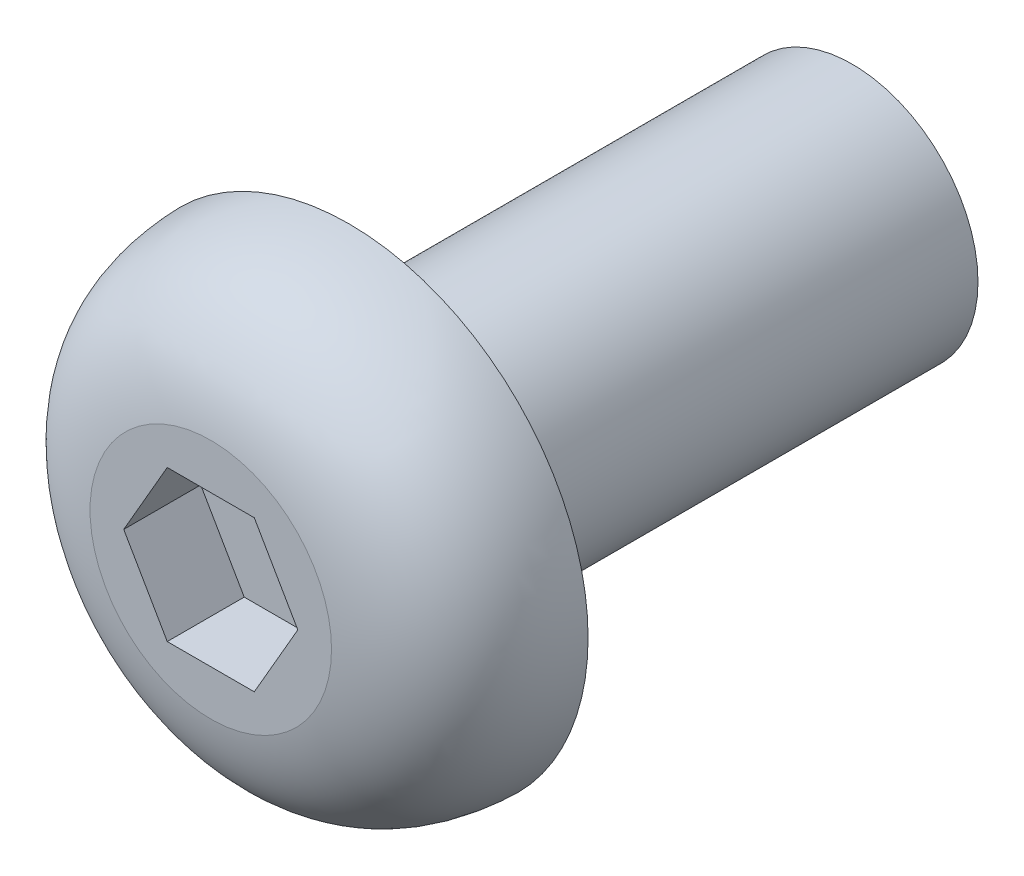
ISO-10303-21;
HEADER;
FILE_DESCRIPTION(('STEP AP214'),'2;1');
FILE_NAME('part.step','',(''),(''),'','','');
FILE_SCHEMA(('AUTOMOTIVE_DESIGN { 1 0 10303 214 1 1 1 1 }'));
ENDSEC;
DATA;
#1=APPLICATION_CONTEXT('core data for automotive mechanical design processes');
#2=APPLICATION_PROTOCOL_DEFINITION('international standard','automotive_design',2000,#1);
#3=PRODUCT_CONTEXT('',#1,'mechanical');
#4=PRODUCT('Part','Part','',(#3));
#5=PRODUCT_RELATED_PRODUCT_CATEGORY('part','',(#4));
#6=PRODUCT_DEFINITION_FORMATION('','',#4);
#7=PRODUCT_DEFINITION_CONTEXT('part definition',#1,'design');
#8=PRODUCT_DEFINITION('design','',#6,#7);
#9=PRODUCT_DEFINITION_SHAPE('','',#8);
#10=(LENGTH_UNIT() NAMED_UNIT(*) SI_UNIT(.MILLI.,.METRE.));
#11=(NAMED_UNIT(*) PLANE_ANGLE_UNIT() SI_UNIT($,.RADIAN.));
#12=(NAMED_UNIT(*) SI_UNIT($,.STERADIAN.) SOLID_ANGLE_UNIT());
#13=UNCERTAINTY_MEASURE_WITH_UNIT(LENGTH_MEASURE(1.E-05),#10,'distance_accuracy_value','');
#14=(GEOMETRIC_REPRESENTATION_CONTEXT(3) GLOBAL_UNCERTAINTY_ASSIGNED_CONTEXT((#13)) GLOBAL_UNIT_ASSIGNED_CONTEXT((#10,
#11,#12)) REPRESENTATION_CONTEXT('',''));
#15=CARTESIAN_POINT('',(0.,0.,0.));
#16=DIRECTION('',(0.,0.,1.));
#17=DIRECTION('',(1.,0.,0.));
#18=AXIS2_PLACEMENT_3D('',#15,#16,#17);
#19=CARTESIAN_POINT('',(0.,0.,1.22));
#20=DIRECTION('',(0.,0.,1.));
#21=DIRECTION('',(1.,0.,0.));
#22=AXIS2_PLACEMENT_3D('',#19,#20,#21);
#23=PLANE('',#22);
#24=DIRECTION('',(-0.50000000000019,0.866025403784329,0.));
#25=VECTOR('',#24,1.);
#26=CARTESIAN_POINT('',(1.73,0.,1.22));
#27=LINE('',#26,#25);
#28=CARTESIAN_POINT('',(1.73,0.,1.22));
#29=VERTEX_POINT('',#28);
#30=CARTESIAN_POINT('',(0.865,1.498223948547,1.22));
#31=VERTEX_POINT('',#30);
#32=EDGE_CURVE('E11',#29,#31,#27,.T.);
#33=ORIENTED_EDGE('',*,*,#32,.T.);
#34=DIRECTION('',(-1.,0.,0.));
#35=VECTOR('',#34,1.);
#36=CARTESIAN_POINT('',(0.865,1.498223948547,1.22));
#37=LINE('',#36,#35);
#38=CARTESIAN_POINT('',(-0.865,1.498223948547,1.22));
#39=VERTEX_POINT('',#38);
#40=EDGE_CURVE('E156',#31,#39,#37,.T.);
#41=ORIENTED_EDGE('',*,*,#40,.T.);
#42=DIRECTION('',(-0.50000000000019,-0.866025403784329,0.));
#43=VECTOR('',#42,1.);
#44=CARTESIAN_POINT('',(-0.865,1.498223948547,1.22));
#45=LINE('',#44,#43);
#46=CARTESIAN_POINT('',(-1.73,0.,1.22));
#47=VERTEX_POINT('',#46);
#48=EDGE_CURVE('E113',#39,#47,#45,.T.);
#49=ORIENTED_EDGE('',*,*,#48,.T.);
#50=DIRECTION('',(0.50000000000019,-0.866025403784329,0.));
#51=VECTOR('',#50,1.);
#52=CARTESIAN_POINT('',(-1.73,0.,1.22));
#53=LINE('',#52,#51);
#54=CARTESIAN_POINT('',(-0.865,-1.498223948547,1.22));
#55=VERTEX_POINT('',#54);
#56=EDGE_CURVE('E110',#47,#55,#53,.T.);
#57=ORIENTED_EDGE('',*,*,#56,.T.);
#58=DIRECTION('',(1.,0.,0.));
#59=VECTOR('',#58,1.);
#60=CARTESIAN_POINT('',(-0.865,-1.498223948547,1.22));
#61=LINE('',#60,#59);
#62=CARTESIAN_POINT('',(0.865,-1.498223948547,1.22));
#63=VERTEX_POINT('',#62);
#64=EDGE_CURVE('E146',#55,#63,#61,.T.);
#65=ORIENTED_EDGE('',*,*,#64,.T.);
#66=DIRECTION('',(0.50000000000019,0.866025403784329,0.));
#67=VECTOR('',#66,1.);
#68=CARTESIAN_POINT('',(0.865,-1.498223948547,1.22));
#69=LINE('',#68,#67);
#70=EDGE_CURVE('E140',#63,#29,#69,.T.);
#71=ORIENTED_EDGE('',*,*,#70,.T.);
#72=EDGE_LOOP('',(#33,#41,#49,#57,#65,#71));
#73=FACE_BOUND('',#72,.T.);
#74=ADVANCED_FACE('F39',(#73),#23,.T.);
#75=CARTESIAN_POINT('',(1.73,0.,1.22));
#76=DIRECTION('',(-0.866025403784329,-0.50000000000019,0.));
#77=DIRECTION('',(-0.50000000000019,0.866025403784329,0.));
#78=AXIS2_PLACEMENT_3D('',#75,#76,#77);
#79=PLANE('',#78);
#80=ORIENTED_EDGE('',*,*,#32,.F.);
#81=DIRECTION('',(0.,0.,1.));
#82=VECTOR('',#81,1.);
#83=CARTESIAN_POINT('',(1.73,0.,1.22));
#84=LINE('',#83,#82);
#85=CARTESIAN_POINT('',(1.73,0.,2.75));
#86=VERTEX_POINT('',#85);
#87=EDGE_CURVE('E167',#29,#86,#84,.T.);
#88=ORIENTED_EDGE('',*,*,#87,.T.);
#89=DIRECTION('',(-0.50000000000019,0.866025403784329,0.));
#90=VECTOR('',#89,1.);
#91=CARTESIAN_POINT('',(1.51375,0.374555987137,2.75));
#92=LINE('',#91,#90);
#93=CARTESIAN_POINT('',(0.865,1.498223948547,2.75));
#94=VERTEX_POINT('',#93);
#95=EDGE_CURVE('E153',#86,#94,#92,.T.);
#96=ORIENTED_EDGE('',*,*,#95,.T.);
#97=DIRECTION('',(0.,0.,1.));
#98=VECTOR('',#97,1.);
#99=CARTESIAN_POINT('',(0.865,1.498223948547,1.22));
#100=LINE('',#99,#98);
#101=EDGE_CURVE('E48',#31,#94,#100,.T.);
#102=ORIENTED_EDGE('',*,*,#101,.F.);
#103=EDGE_LOOP('',(#80,#88,#96,#102));
#104=FACE_BOUND('',#103,.T.);
#105=ADVANCED_FACE('F193',(#104),#79,.T.);
#106=CARTESIAN_POINT('',(0.865,1.498223948547,1.22));
#107=DIRECTION('',(0.,-1.,0.));
#108=DIRECTION('',(-1.,0.,0.));
#109=AXIS2_PLACEMENT_3D('',#106,#107,#108);
#110=PLANE('',#109);
#111=ORIENTED_EDGE('',*,*,#40,.F.);
#112=ORIENTED_EDGE('',*,*,#101,.T.);
#113=DIRECTION('',(-1.,0.,0.));
#114=VECTOR('',#113,1.);
#115=CARTESIAN_POINT('',(0.4325,1.498223948547,2.75));
#116=LINE('',#115,#114);
#117=CARTESIAN_POINT('',(-0.865,1.498223948547,2.75));
#118=VERTEX_POINT('',#117);
#119=EDGE_CURVE('E123',#94,#118,#116,.T.);
#120=ORIENTED_EDGE('',*,*,#119,.T.);
#121=DIRECTION('',(0.,0.,1.));
#122=VECTOR('',#121,1.);
#123=CARTESIAN_POINT('',(-0.865,1.498223948547,1.22));
#124=LINE('',#123,#122);
#125=EDGE_CURVE('E119',#39,#118,#124,.T.);
#126=ORIENTED_EDGE('',*,*,#125,.F.);
#127=EDGE_LOOP('',(#111,#112,#120,#126));
#128=FACE_BOUND('',#127,.T.);
#129=ADVANCED_FACE('F160',(#128),#110,.T.);
#130=CARTESIAN_POINT('',(-0.865,1.498223948547,1.22));
#131=DIRECTION('',(0.866025403784329,-0.50000000000019,0.));
#132=DIRECTION('',(0.,0.,-1.));
#133=AXIS2_PLACEMENT_3D('',#130,#131,#132);
#134=PLANE('',#133);
#135=ORIENTED_EDGE('',*,*,#48,.F.);
#136=ORIENTED_EDGE('',*,*,#125,.T.);
#137=DIRECTION('',(-0.50000000000019,-0.866025403784329,0.));
#138=VECTOR('',#137,1.);
#139=CARTESIAN_POINT('',(-1.08125,1.12366796141,2.75));
#140=LINE('',#139,#138);
#141=CARTESIAN_POINT('',(-1.73,0.,2.75));
#142=VERTEX_POINT('',#141);
#143=EDGE_CURVE('E116',#118,#142,#140,.T.);
#144=ORIENTED_EDGE('',*,*,#143,.T.);
#145=DIRECTION('',(0.,0.,1.));
#146=VECTOR('',#145,1.);
#147=CARTESIAN_POINT('',(-1.73,0.,1.22));
#148=LINE('',#147,#146);
#149=EDGE_CURVE('E103',#47,#142,#148,.T.);
#150=ORIENTED_EDGE('',*,*,#149,.F.);
#151=EDGE_LOOP('',(#135,#136,#144,#150));
#152=FACE_BOUND('',#151,.T.);
#153=ADVANCED_FACE('F117',(#152),#134,.T.);
#154=CARTESIAN_POINT('',(-1.73,0.,1.22));
#155=DIRECTION('',(0.866025403784329,0.50000000000019,0.));
#156=DIRECTION('',(0.,0.,-1.));
#157=AXIS2_PLACEMENT_3D('',#154,#155,#156);
#158=PLANE('',#157);
#159=ORIENTED_EDGE('',*,*,#56,.F.);
#160=ORIENTED_EDGE('',*,*,#149,.T.);
#161=DIRECTION('',(0.50000000000019,-0.866025403784329,0.));
#162=VECTOR('',#161,1.);
#163=CARTESIAN_POINT('',(-1.51375,-0.374555987137,2.75));
#164=LINE('',#163,#162);
#165=CARTESIAN_POINT('',(-0.865,-1.498223948547,2.75));
#166=VERTEX_POINT('',#165);
#167=EDGE_CURVE('E108',#142,#166,#164,.T.);
#168=ORIENTED_EDGE('',*,*,#167,.T.);
#169=DIRECTION('',(0.,0.,1.));
#170=VECTOR('',#169,1.);
#171=CARTESIAN_POINT('',(-0.865,-1.498223948547,1.22));
#172=LINE('',#171,#170);
#173=EDGE_CURVE('E144',#55,#166,#172,.T.);
#174=ORIENTED_EDGE('',*,*,#173,.F.);
#175=EDGE_LOOP('',(#159,#160,#168,#174));
#176=FACE_BOUND('',#175,.T.);
#177=ADVANCED_FACE('F105',(#176),#158,.T.);
#178=CARTESIAN_POINT('',(-0.865,-1.498223948547,1.22));
#179=DIRECTION('',(0.,1.,0.));
#180=DIRECTION('',(1.,0.,0.));
#181=AXIS2_PLACEMENT_3D('',#178,#179,#180);
#182=PLANE('',#181);
#183=ORIENTED_EDGE('',*,*,#64,.F.);
#184=ORIENTED_EDGE('',*,*,#173,.T.);
#185=DIRECTION('',(1.,0.,0.));
#186=VECTOR('',#185,1.);
#187=CARTESIAN_POINT('',(-0.4325,-1.498223948547,2.75));
#188=LINE('',#187,#186);
#189=CARTESIAN_POINT('',(0.865,-1.498223948547,2.75));
#190=VERTEX_POINT('',#189);
#191=EDGE_CURVE('E129',#166,#190,#188,.T.);
#192=ORIENTED_EDGE('',*,*,#191,.T.);
#193=DIRECTION('',(0.,0.,1.));
#194=VECTOR('',#193,1.);
#195=CARTESIAN_POINT('',(0.865,-1.498223948547,1.22));
#196=LINE('',#195,#194);
#197=EDGE_CURVE('E142',#63,#190,#196,.T.);
#198=ORIENTED_EDGE('',*,*,#197,.F.);
#199=EDGE_LOOP('',(#183,#184,#192,#198));
#200=FACE_BOUND('',#199,.T.);
#201=ADVANCED_FACE('F215',(#200),#182,.T.);
#202=CARTESIAN_POINT('',(0.865,-1.498223948547,1.22));
#203=DIRECTION('',(-0.866025403784329,0.50000000000019,0.));
#204=DIRECTION('',(0.,0.,1.));
#205=AXIS2_PLACEMENT_3D('',#202,#203,#204);
#206=PLANE('',#205);
#207=ORIENTED_EDGE('',*,*,#70,.F.);
#208=ORIENTED_EDGE('',*,*,#197,.T.);
#209=DIRECTION('',(0.50000000000019,0.866025403784329,0.));
#210=VECTOR('',#209,1.);
#211=CARTESIAN_POINT('',(1.08125,-1.12366796141,2.75));
#212=LINE('',#211,#210);
#213=EDGE_CURVE('E143',#190,#86,#212,.T.);
#214=ORIENTED_EDGE('',*,*,#213,.T.);
#215=ORIENTED_EDGE('',*,*,#87,.F.);
#216=EDGE_LOOP('',(#207,#208,#214,#215));
#217=FACE_BOUND('',#216,.T.);
#218=ADVANCED_FACE('F217',(#217),#206,.T.);
#219=CARTESIAN_POINT('',(0.,0.,2.75));
#220=DIRECTION('',(0.,0.,1.));
#221=DIRECTION('',(1.,0.,0.));
#222=AXIS2_PLACEMENT_3D('',#219,#220,#221);
#223=PLANE('',#222);
#224=ORIENTED_EDGE('',*,*,#191,.F.);
#225=ORIENTED_EDGE('',*,*,#167,.F.);
#226=ORIENTED_EDGE('',*,*,#143,.F.);
#227=ORIENTED_EDGE('',*,*,#119,.F.);
#228=ORIENTED_EDGE('',*,*,#95,.F.);
#229=ORIENTED_EDGE('',*,*,#213,.F.);
#230=EDGE_LOOP('',(#224,#225,#226,#227,#228,#229));
#231=FACE_BOUND('',#230,.T.);
#232=CARTESIAN_POINT('',(0.,0.,2.75));
#233=DIRECTION('',(0.,0.,1.));
#234=DIRECTION('',(1.,0.,0.));
#235=AXIS2_PLACEMENT_3D('',#232,#233,#234);
#236=CIRCLE('',#235,2.4);
#237=CARTESIAN_POINT('',(2.4,0.,2.75));
#238=VERTEX_POINT('',#237);
#239=EDGE_CURVE('E131',#238,#238,#236,.T.);
#240=ORIENTED_EDGE('',*,*,#239,.T.);
#241=EDGE_LOOP('',(#240));
#242=FACE_BOUND('',#241,.T.);
#243=ADVANCED_FACE('F125',(#231,#242),#223,.T.);
#244=CARTESIAN_POINT('',(2.4,0.,2.75));
#245=CARTESIAN_POINT('',(3.850094,0.,2.523722));
#246=CARTESIAN_POINT('',(4.693085,0.,1.688395));
#247=CARTESIAN_POINT('',(4.75,0.,0.));
#248=(BOUNDED_CURVE() B_SPLINE_CURVE(3,(#244,#245,#246,#247),.UNSPECIFIED.,.F.,
.F.) B_SPLINE_CURVE_WITH_KNOTS((4,4),(0.,1.),
.UNSPECIFIED.) CURVE() GEOMETRIC_REPRESENTATION_ITEM() RATIONAL_B_SPLINE_CURVE((1.,1.,1.,1.)) REPRESENTATION_ITEM(''));
#249=CARTESIAN_POINT('',(0.,0.,0.));
#250=DIRECTION('',(0.,0.,-1.));
#251=AXIS1_PLACEMENT('',#249,#250);
#252=SURFACE_OF_REVOLUTION('',#248,#251);
#253=CARTESIAN_POINT('',(2.4,0.,2.75));
#254=CARTESIAN_POINT('',(3.850094,0.,2.523722));
#255=CARTESIAN_POINT('',(4.693085,0.,1.688395));
#256=CARTESIAN_POINT('',(4.75,0.,0.));
#257=(BOUNDED_CURVE() B_SPLINE_CURVE(3,(#253,#254,#255,#256),.UNSPECIFIED.,.F.,
.F.) B_SPLINE_CURVE_WITH_KNOTS((4,4),(0.,1.),
.UNSPECIFIED.) CURVE() GEOMETRIC_REPRESENTATION_ITEM() RATIONAL_B_SPLINE_CURVE((1.,1.,1.,1.)) REPRESENTATION_ITEM(''));
#258=CARTESIAN_POINT('',(4.75,0.,0.));
#259=VERTEX_POINT('',#258);
#260=EDGE_CURVE('E138',#238,#259,#257,.T.);
#261=ORIENTED_EDGE('',*,*,#260,.T.);
#262=CARTESIAN_POINT('',(0.,0.,0.));
#263=DIRECTION('',(0.,0.,1.));
#264=DIRECTION('',(1.,0.,0.));
#265=AXIS2_PLACEMENT_3D('',#262,#263,#264);
#266=CIRCLE('',#265,4.75);
#267=EDGE_CURVE('E135',#259,#259,#266,.T.);
#268=ORIENTED_EDGE('',*,*,#267,.T.);
#269=ORIENTED_EDGE('',*,*,#260,.F.);
#270=ORIENTED_EDGE('',*,*,#239,.F.);
#271=EDGE_LOOP('',(#261,#268,#269,#270));
#272=FACE_BOUND('',#271,.T.);
#273=ADVANCED_FACE('F181',(#272),#252,.T.);
#274=CARTESIAN_POINT('',(0.,0.,0.));
#275=DIRECTION('',(0.,0.,1.));
#276=DIRECTION('',(1.,0.,0.));
#277=AXIS2_PLACEMENT_3D('',#274,#275,#276);
#278=PLANE('',#277);
#279=ORIENTED_EDGE('',*,*,#267,.F.);
#280=EDGE_LOOP('',(#279));
#281=FACE_BOUND('',#280,.T.);
#282=CARTESIAN_POINT('',(0.,0.,0.));
#283=DIRECTION('',(0.,0.,1.));
#284=DIRECTION('',(1.,0.,0.));
#285=AXIS2_PLACEMENT_3D('',#282,#283,#284);
#286=CIRCLE('',#285,2.5);
#287=CARTESIAN_POINT('',(2.5,0.,0.));
#288=VERTEX_POINT('',#287);
#289=EDGE_CURVE('E139',#288,#288,#286,.T.);
#290=ORIENTED_EDGE('',*,*,#289,.T.);
#291=EDGE_LOOP('',(#290));
#292=FACE_BOUND('',#291,.T.);
#293=ADVANCED_FACE('F41',(#281,#292),#278,.F.);
#294=CARTESIAN_POINT('',(0.,0.,-29.50000000004));
#295=DIRECTION('',(0.,0.,1.));
#296=DIRECTION('',(1.,0.,0.));
#297=AXIS2_PLACEMENT_3D('',#294,#295,#296);
#298=CYLINDRICAL_SURFACE('',#297,2.5);
#299=CARTESIAN_POINT('',(0.,0.,-10.));
#300=DIRECTION('',(0.,0.,1.));
#301=DIRECTION('',(1.,0.,0.));
#302=AXIS2_PLACEMENT_3D('',#299,#300,#301);
#303=CIRCLE('',#302,2.5);
#304=CARTESIAN_POINT('',(2.5,0.,-10.));
#305=VERTEX_POINT('',#304);
#306=EDGE_CURVE('E43',#305,#305,#303,.F.);
#307=ORIENTED_EDGE('',*,*,#306,.F.);
#308=DIRECTION('',(0.,0.,1.));
#309=VECTOR('',#308,1.);
#310=CARTESIAN_POINT('',(2.5,0.,-29.50000000004));
#311=LINE('',#310,#309);
#312=EDGE_CURVE('E174',#305,#288,#311,.T.);
#313=ORIENTED_EDGE('',*,*,#312,.T.);
#314=ORIENTED_EDGE('',*,*,#289,.F.);
#315=ORIENTED_EDGE('',*,*,#312,.F.);
#316=EDGE_LOOP('',(#307,#313,#314,#315));
#317=FACE_BOUND('',#316,.T.);
#318=ADVANCED_FACE('F178',(#317),#298,.T.);
#319=CARTESIAN_POINT('',(0.,0.,-10.));
#320=DIRECTION('',(0.,0.,1.));
#321=DIRECTION('',(1.,0.,0.));
#322=AXIS2_PLACEMENT_3D('',#319,#320,#321);
#323=PLANE('',#322);
#324=ORIENTED_EDGE('',*,*,#306,.T.);
#325=EDGE_LOOP('',(#324));
#326=FACE_BOUND('',#325,.T.);
#327=ADVANCED_FACE('F187',(#326),#323,.F.);
#328=CLOSED_SHELL('',(#74,#105,#129,#153,#177,#201,#218,#243,#273,#293,#318,#327));
#329=MANIFOLD_SOLID_BREP('B2',#328);
#330=ADVANCED_BREP_SHAPE_REPRESENTATION('',(#18,#329),#14);
#331=SHAPE_DEFINITION_REPRESENTATION(#9,#330);
ENDSEC;
END-ISO-10303-21;
